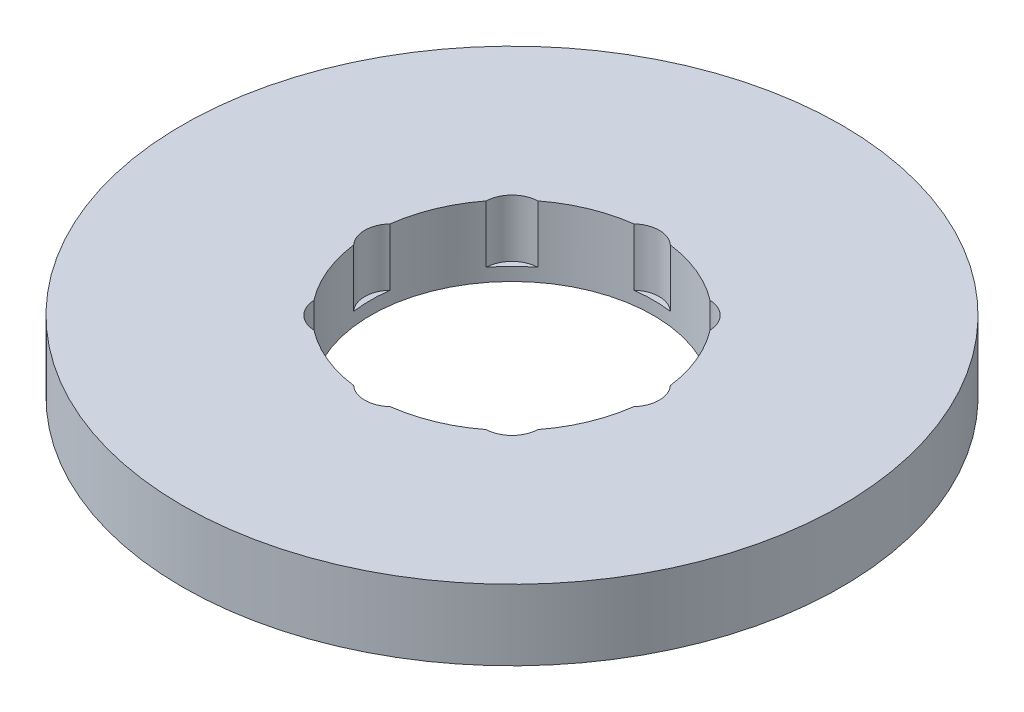
ISO-10303-21;
HEADER;
FILE_DESCRIPTION(('STEP AP214'),'2;1');
FILE_NAME('part.step','',(''),(''),'','','');
FILE_SCHEMA(('AUTOMOTIVE_DESIGN { 1 0 10303 214 1 1 1 1 }'));
ENDSEC;
DATA;
#1=APPLICATION_CONTEXT('core data for automotive mechanical design processes');
#2=APPLICATION_PROTOCOL_DEFINITION('international standard','automotive_design',2000,#1);
#3=PRODUCT_CONTEXT('',#1,'mechanical');
#4=PRODUCT('Part','Part','',(#3));
#5=PRODUCT_RELATED_PRODUCT_CATEGORY('part','',(#4));
#6=PRODUCT_DEFINITION_FORMATION('','',#4);
#7=PRODUCT_DEFINITION_CONTEXT('part definition',#1,'design');
#8=PRODUCT_DEFINITION('design','',#6,#7);
#9=PRODUCT_DEFINITION_SHAPE('','',#8);
#10=(LENGTH_UNIT() NAMED_UNIT(*) SI_UNIT(.MILLI.,.METRE.));
#11=(NAMED_UNIT(*) PLANE_ANGLE_UNIT() SI_UNIT($,.RADIAN.));
#12=(NAMED_UNIT(*) SI_UNIT($,.STERADIAN.) SOLID_ANGLE_UNIT());
#13=UNCERTAINTY_MEASURE_WITH_UNIT(LENGTH_MEASURE(1.E-05),#10,'distance_accuracy_value','');
#14=(GEOMETRIC_REPRESENTATION_CONTEXT(3) GLOBAL_UNCERTAINTY_ASSIGNED_CONTEXT((#13)) GLOBAL_UNIT_ASSIGNED_CONTEXT((#10,
#11,#12)) REPRESENTATION_CONTEXT('',''));
#15=CARTESIAN_POINT('',(0.,0.,0.));
#16=DIRECTION('',(0.,0.,1.));
#17=DIRECTION('',(1.,0.,0.));
#18=AXIS2_PLACEMENT_3D('',#15,#16,#17);
#19=CARTESIAN_POINT('',(0.,15.,0.));
#20=DIRECTION('',(0.,-1.,0.));
#21=DIRECTION('',(0.,0.,-1.));
#22=AXIS2_PLACEMENT_3D('',#19,#20,#21);
#23=CYLINDRICAL_SURFACE('',#22,70.);
#24=CARTESIAN_POINT('',(0.,15.,0.));
#25=DIRECTION('',(0.,1.,0.));
#26=DIRECTION('',(0.,0.,1.));
#27=AXIS2_PLACEMENT_3D('',#24,#25,#26);
#28=CIRCLE('',#27,70.);
#29=CARTESIAN_POINT('',(0.,15.,70.));
#30=VERTEX_POINT('',#29);
#31=EDGE_CURVE('E183',#30,#30,#28,.T.);
#32=ORIENTED_EDGE('',*,*,#31,.F.);
#33=EDGE_LOOP('',(#32));
#34=FACE_BOUND('',#33,.T.);
#35=CARTESIAN_POINT('',(0.,0.,0.));
#36=DIRECTION('',(0.,1.,0.));
#37=DIRECTION('',(0.,0.,1.));
#38=AXIS2_PLACEMENT_3D('',#35,#36,#37);
#39=CIRCLE('',#38,70.);
#40=CARTESIAN_POINT('',(0.,0.,70.));
#41=VERTEX_POINT('',#40);
#42=EDGE_CURVE('E182',#41,#41,#39,.T.);
#43=ORIENTED_EDGE('',*,*,#42,.T.);
#44=EDGE_LOOP('',(#43));
#45=FACE_BOUND('',#44,.T.);
#46=ADVANCED_FACE('F39',(#34,#45),#23,.T.);
#47=CARTESIAN_POINT('',(0.,15.,0.));
#48=DIRECTION('',(0.,1.,0.));
#49=DIRECTION('',(0.,0.,1.));
#50=AXIS2_PLACEMENT_3D('',#47,#48,#49);
#51=PLANE('',#50);
#52=CARTESIAN_POINT('',(0.,15.,25.5649603213193));
#53=DIRECTION('',(0.,1.,0.));
#54=DIRECTION('',(1.,0.,0.));
#55=AXIS2_PLACEMENT_3D('',#52,#53,#54);
#56=CIRCLE('',#55,5.70528538630194);
#57=CARTESIAN_POINT('',(-3.87966494125116,15.,29.7480789286237));
#58=VERTEX_POINT('',#57);
#59=CARTESIAN_POINT('',(3.87966494125137,15.,29.7480789286237));
#60=VERTEX_POINT('',#59);
#61=EDGE_CURVE('E256',#58,#60,#56,.T.);
#62=ORIENTED_EDGE('',*,*,#61,.F.);
#63=CARTESIAN_POINT('',(0.,15.,0.));
#64=DIRECTION('',(0.,1.,0.));
#65=DIRECTION('',(0.,0.,1.));
#66=AXIS2_PLACEMENT_3D('',#63,#64,#65);
#67=CIRCLE('',#66,30.);
#68=CARTESIAN_POINT('',(-18.291730949012,15.,23.778405726393));
#69=VERTEX_POINT('',#68);
#70=EDGE_CURVE('E175',#69,#58,#67,.T.);
#71=ORIENTED_EDGE('',*,*,#70,.F.);
#72=CARTESIAN_POINT('',(-18.0771568039699,15.,18.0771568039699));
#73=DIRECTION('',(0.,1.,0.));
#74=DIRECTION('',(0.707106781186549,0.,0.707106781186546));
#75=AXIS2_PLACEMENT_3D('',#72,#73,#74);
#76=CIRCLE('',#75,5.70528538630194);
#77=CARTESIAN_POINT('',(-23.7784057263929,15.,18.291730949012));
#78=VERTEX_POINT('',#77);
#79=EDGE_CURVE('E152',#78,#69,#76,.T.);
#80=ORIENTED_EDGE('',*,*,#79,.F.);
#81=CARTESIAN_POINT('',(-29.7480789286237,15.,3.87966494125126));
#82=VERTEX_POINT('',#81);
#83=EDGE_CURVE('E168',#82,#78,#67,.T.);
#84=ORIENTED_EDGE('',*,*,#83,.F.);
#85=CARTESIAN_POINT('',(-25.5649603213193,15.,0.));
#86=DIRECTION('',(0.,1.,0.));
#87=DIRECTION('',(0.,0.,1.));
#88=AXIS2_PLACEMENT_3D('',#85,#86,#87);
#89=CIRCLE('',#88,5.70528538630194);
#90=CARTESIAN_POINT('',(-29.7480789286237,15.,-3.87966494125126));
#91=VERTEX_POINT('',#90);
#92=EDGE_CURVE('E205',#91,#82,#89,.T.);
#93=ORIENTED_EDGE('',*,*,#92,.F.);
#94=CARTESIAN_POINT('',(-23.7784057263932,15.,-18.2917309490117));
#95=VERTEX_POINT('',#94);
#96=EDGE_CURVE('E181',#95,#91,#67,.T.);
#97=ORIENTED_EDGE('',*,*,#96,.F.);
#98=CARTESIAN_POINT('',(-18.0771568039701,15.,-18.0771568039697));
#99=DIRECTION('',(0.,1.,0.));
#100=DIRECTION('',(-0.707106781186539,0.,0.707106781186556));
#101=AXIS2_PLACEMENT_3D('',#98,#99,#100);
#102=CIRCLE('',#101,5.70528538630194);
#103=CARTESIAN_POINT('',(-18.2917309490123,15.,-23.7784057263927));
#104=VERTEX_POINT('',#103);
#105=EDGE_CURVE('E453',#104,#95,#102,.T.);
#106=ORIENTED_EDGE('',*,*,#105,.F.);
#107=CARTESIAN_POINT('',(-3.87966494125158,15.,-29.7480789286237));
#108=VERTEX_POINT('',#107);
#109=EDGE_CURVE('E189',#108,#104,#67,.T.);
#110=ORIENTED_EDGE('',*,*,#109,.F.);
#111=CARTESIAN_POINT('',(-2.67778745670455E-13,15.,-25.5649603213193));
#112=DIRECTION('',(0.,1.,0.));
#113=DIRECTION('',(-1.,0.,0.));
#114=AXIS2_PLACEMENT_3D('',#111,#112,#113);
#115=CIRCLE('',#114,5.70528538630194);
#116=CARTESIAN_POINT('',(3.87966494125095,15.,-29.7480789286237));
#117=VERTEX_POINT('',#116);
#118=EDGE_CURVE('E462',#117,#108,#115,.T.);
#119=ORIENTED_EDGE('',*,*,#118,.F.);
#120=CARTESIAN_POINT('',(18.2917309490118,15.,-23.7784057263931));
#121=VERTEX_POINT('',#120);
#122=EDGE_CURVE('E197',#121,#117,#67,.T.);
#123=ORIENTED_EDGE('',*,*,#122,.F.);
#124=CARTESIAN_POINT('',(18.0771568039697,15.,-18.0771568039701));
#125=DIRECTION('',(0.,1.,0.));
#126=DIRECTION('',(-0.707106781186554,0.,-0.707106781186541));
#127=AXIS2_PLACEMENT_3D('',#124,#125,#126);
#128=CIRCLE('',#127,5.70528538630194);
#129=CARTESIAN_POINT('',(23.7784057263928,15.,-18.2917309490122));
#130=VERTEX_POINT('',#129);
#131=EDGE_CURVE('E470',#130,#121,#128,.T.);
#132=ORIENTED_EDGE('',*,*,#131,.F.);
#133=CARTESIAN_POINT('',(29.7480789286237,15.,-3.87966494125126));
#134=VERTEX_POINT('',#133);
#135=EDGE_CURVE('E489',#134,#130,#67,.T.);
#136=ORIENTED_EDGE('',*,*,#135,.F.);
#137=CARTESIAN_POINT('',(25.5649603213193,15.,0.));
#138=DIRECTION('',(0.,1.,0.));
#139=DIRECTION('',(0.,0.,-1.));
#140=AXIS2_PLACEMENT_3D('',#137,#138,#139);
#141=CIRCLE('',#140,5.70528538630194);
#142=CARTESIAN_POINT('',(29.7480789286237,15.,3.87966494125126));
#143=VERTEX_POINT('',#142);
#144=EDGE_CURVE('E476',#143,#134,#141,.T.);
#145=ORIENTED_EDGE('',*,*,#144,.F.);
#146=CARTESIAN_POINT('',(23.778405726393,15.,18.2917309490119));
#147=VERTEX_POINT('',#146);
#148=EDGE_CURVE('E491',#147,#143,#67,.T.);
#149=ORIENTED_EDGE('',*,*,#148,.F.);
#150=CARTESIAN_POINT('',(18.07715680397,15.,18.0771568039698));
#151=DIRECTION('',(0.,1.,0.));
#152=DIRECTION('',(0.707106781186544,0.,-0.707106781186551));
#153=AXIS2_PLACEMENT_3D('',#150,#151,#152);
#154=CIRCLE('',#153,5.70528538630194);
#155=CARTESIAN_POINT('',(18.2917309490121,15.,23.7784057263928));
#156=VERTEX_POINT('',#155);
#157=EDGE_CURVE('E475',#156,#147,#154,.T.);
#158=ORIENTED_EDGE('',*,*,#157,.F.);
#159=EDGE_CURVE('E190',#60,#156,#67,.T.);
#160=ORIENTED_EDGE('',*,*,#159,.F.);
#161=EDGE_LOOP('',(#62,#71,#80,#84,#93,#97,#106,#110,#119,#123,#132,#136,#145,#149,#158,#160));
#162=FACE_BOUND('',#161,.T.);
#163=ORIENTED_EDGE('',*,*,#31,.T.);
#164=EDGE_LOOP('',(#163));
#165=FACE_BOUND('',#164,.T.);
#166=ADVANCED_FACE('F170',(#162,#165),#51,.T.);
#167=CARTESIAN_POINT('',(0.,0.,0.));
#168=DIRECTION('',(0.,1.,0.));
#169=DIRECTION('',(0.,0.,1.));
#170=AXIS2_PLACEMENT_3D('',#167,#168,#169);
#171=PLANE('',#170);
#172=CARTESIAN_POINT('',(0.,0.,0.));
#173=DIRECTION('',(0.,1.,0.));
#174=DIRECTION('',(0.,0.,1.));
#175=AXIS2_PLACEMENT_3D('',#172,#173,#174);
#176=CIRCLE('',#175,30.);
#177=CARTESIAN_POINT('',(0.,0.,30.));
#178=VERTEX_POINT('',#177);
#179=EDGE_CURVE('E191',#178,#178,#176,.T.);
#180=ORIENTED_EDGE('',*,*,#179,.T.);
#181=EDGE_LOOP('',(#180));
#182=FACE_BOUND('',#181,.T.);
#183=ORIENTED_EDGE('',*,*,#42,.F.);
#184=EDGE_LOOP('',(#183));
#185=FACE_BOUND('',#184,.T.);
#186=ADVANCED_FACE('F277',(#182,#185),#171,.F.);
#187=CARTESIAN_POINT('',(0.,15.,0.));
#188=DIRECTION('',(0.,-1.,0.));
#189=DIRECTION('',(0.,0.,-1.));
#190=AXIS2_PLACEMENT_3D('',#187,#188,#189);
#191=CYLINDRICAL_SURFACE('',#190,30.);
#192=DIRECTION('',(0.,1.,0.));
#193=VECTOR('',#192,1.);
#194=CARTESIAN_POINT('',(-3.87966494125118,8.89638853081518,29.7480789286237));
#195=LINE('',#194,#193);
#196=CARTESIAN_POINT('',(-3.87966494125116,2.79277706163036,29.7480789286237));
#197=VERTEX_POINT('',#196);
#198=EDGE_CURVE('E11',#197,#58,#195,.T.);
#199=ORIENTED_EDGE('',*,*,#198,.F.);
#200=CARTESIAN_POINT('',(0.,2.79277706163036,0.));
#201=DIRECTION('',(0.,1.,0.));
#202=DIRECTION('',(0.,0.,1.));
#203=AXIS2_PLACEMENT_3D('',#200,#201,#202);
#204=CIRCLE('',#203,30.);
#205=CARTESIAN_POINT('',(3.87966494125137,2.79277706163036,29.7480789286237));
#206=VERTEX_POINT('',#205);
#207=EDGE_CURVE('E251',#197,#206,#204,.T.);
#208=ORIENTED_EDGE('',*,*,#207,.T.);
#209=DIRECTION('',(0.,1.,0.));
#210=VECTOR('',#209,1.);
#211=CARTESIAN_POINT('',(3.87966494125139,8.89638853081518,29.7480789286237));
#212=LINE('',#211,#210);
#213=EDGE_CURVE('E46',#60,#206,#212,.F.);
#214=ORIENTED_EDGE('',*,*,#213,.F.);
#215=ORIENTED_EDGE('',*,*,#159,.T.);
#216=DIRECTION('',(0.,1.,0.));
#217=VECTOR('',#216,1.);
#218=CARTESIAN_POINT('',(18.2917309490121,8.89638853081518,23.7784057263928));
#219=LINE('',#218,#217);
#220=CARTESIAN_POINT('',(18.2917309490121,2.79277706163036,23.7784057263928));
#221=VERTEX_POINT('',#220);
#222=EDGE_CURVE('E253',#221,#156,#219,.T.);
#223=ORIENTED_EDGE('',*,*,#222,.F.);
#224=CARTESIAN_POINT('',(0.,2.79277706163036,0.));
#225=DIRECTION('',(0.,1.,0.));
#226=DIRECTION('',(0.,0.,1.));
#227=AXIS2_PLACEMENT_3D('',#224,#225,#226);
#228=CIRCLE('',#227,30.);
#229=CARTESIAN_POINT('',(23.778405726393,2.79277706163036,18.2917309490119));
#230=VERTEX_POINT('',#229);
#231=EDGE_CURVE('E246',#221,#230,#228,.T.);
#232=ORIENTED_EDGE('',*,*,#231,.T.);
#233=DIRECTION('',(0.,1.,0.));
#234=VECTOR('',#233,1.);
#235=CARTESIAN_POINT('',(23.778405726393,8.89638853081518,18.2917309490118));
#236=LINE('',#235,#234);
#237=EDGE_CURVE('E248',#147,#230,#236,.F.);
#238=ORIENTED_EDGE('',*,*,#237,.F.);
#239=ORIENTED_EDGE('',*,*,#148,.T.);
#240=DIRECTION('',(0.,1.,0.));
#241=VECTOR('',#240,1.);
#242=CARTESIAN_POINT('',(29.7480789286237,8.89638853081518,3.87966494125128));
#243=LINE('',#242,#241);
#244=CARTESIAN_POINT('',(29.7480789286237,2.79277706163036,3.87966494125126));
#245=VERTEX_POINT('',#244);
#246=EDGE_CURVE('E243',#245,#143,#243,.T.);
#247=ORIENTED_EDGE('',*,*,#246,.F.);
#248=CARTESIAN_POINT('',(0.,2.79277706163036,0.));
#249=DIRECTION('',(0.,1.,0.));
#250=DIRECTION('',(0.,0.,1.));
#251=AXIS2_PLACEMENT_3D('',#248,#249,#250);
#252=CIRCLE('',#251,30.);
#253=CARTESIAN_POINT('',(29.7480789286237,2.79277706163036,-3.87966494125126));
#254=VERTEX_POINT('',#253);
#255=EDGE_CURVE('E236',#245,#254,#252,.T.);
#256=ORIENTED_EDGE('',*,*,#255,.T.);
#257=DIRECTION('',(0.,1.,0.));
#258=VECTOR('',#257,1.);
#259=CARTESIAN_POINT('',(29.7480789286237,8.89638853081518,-3.87966494125128));
#260=LINE('',#259,#258);
#261=EDGE_CURVE('E241',#134,#254,#260,.F.);
#262=ORIENTED_EDGE('',*,*,#261,.F.);
#263=ORIENTED_EDGE('',*,*,#135,.T.);
#264=DIRECTION('',(0.,1.,0.));
#265=VECTOR('',#264,1.);
#266=CARTESIAN_POINT('',(23.7784057263928,8.89638853081518,-18.2917309490122));
#267=LINE('',#266,#265);
#268=CARTESIAN_POINT('',(23.7784057263928,2.79277706163036,-18.2917309490122));
#269=VERTEX_POINT('',#268);
#270=EDGE_CURVE('E237',#269,#130,#267,.T.);
#271=ORIENTED_EDGE('',*,*,#270,.F.);
#272=CARTESIAN_POINT('',(0.,2.79277706163036,0.));
#273=DIRECTION('',(0.,1.,0.));
#274=DIRECTION('',(0.,0.,1.));
#275=AXIS2_PLACEMENT_3D('',#272,#273,#274);
#276=CIRCLE('',#275,30.);
#277=CARTESIAN_POINT('',(18.2917309490118,2.79277706163036,-23.7784057263931));
#278=VERTEX_POINT('',#277);
#279=EDGE_CURVE('E229',#269,#278,#276,.T.);
#280=ORIENTED_EDGE('',*,*,#279,.T.);
#281=DIRECTION('',(0.,1.,0.));
#282=VECTOR('',#281,1.);
#283=CARTESIAN_POINT('',(18.2917309490118,8.89638853081518,-23.7784057263931));
#284=LINE('',#283,#282);
#285=EDGE_CURVE('E232',#121,#278,#284,.F.);
#286=ORIENTED_EDGE('',*,*,#285,.F.);
#287=ORIENTED_EDGE('',*,*,#122,.T.);
#288=DIRECTION('',(0.,1.,0.));
#289=VECTOR('',#288,1.);
#290=CARTESIAN_POINT('',(3.87966494125097,8.89638853081518,-29.7480789286237));
#291=LINE('',#290,#289);
#292=CARTESIAN_POINT('',(3.87966494125095,2.79277706163036,-29.7480789286237));
#293=VERTEX_POINT('',#292);
#294=EDGE_CURVE('E227',#293,#117,#291,.T.);
#295=ORIENTED_EDGE('',*,*,#294,.F.);
#296=CARTESIAN_POINT('',(0.,2.79277706163036,0.));
#297=DIRECTION('',(0.,1.,0.));
#298=DIRECTION('',(0.,0.,1.));
#299=AXIS2_PLACEMENT_3D('',#296,#297,#298);
#300=CIRCLE('',#299,30.);
#301=CARTESIAN_POINT('',(-3.87966494125158,2.79277706163036,-29.7480789286237));
#302=VERTEX_POINT('',#301);
#303=EDGE_CURVE('E225',#293,#302,#300,.T.);
#304=ORIENTED_EDGE('',*,*,#303,.T.);
#305=DIRECTION('',(0.,1.,0.));
#306=VECTOR('',#305,1.);
#307=CARTESIAN_POINT('',(-3.87966494125159,8.89638853081518,-29.7480789286236));
#308=LINE('',#307,#306);
#309=EDGE_CURVE('E223',#108,#302,#308,.F.);
#310=ORIENTED_EDGE('',*,*,#309,.F.);
#311=ORIENTED_EDGE('',*,*,#109,.T.);
#312=DIRECTION('',(0.,1.,0.));
#313=VECTOR('',#312,1.);
#314=CARTESIAN_POINT('',(-18.2917309490123,8.89638853081518,-23.7784057263927));
#315=LINE('',#314,#313);
#316=CARTESIAN_POINT('',(-18.2917309490123,2.79277706163036,-23.7784057263927));
#317=VERTEX_POINT('',#316);
#318=EDGE_CURVE('E219',#317,#104,#315,.T.);
#319=ORIENTED_EDGE('',*,*,#318,.F.);
#320=CARTESIAN_POINT('',(0.,2.79277706163036,0.));
#321=DIRECTION('',(0.,1.,0.));
#322=DIRECTION('',(0.,0.,1.));
#323=AXIS2_PLACEMENT_3D('',#320,#321,#322);
#324=CIRCLE('',#323,30.);
#325=CARTESIAN_POINT('',(-23.7784057263932,2.79277706163036,-18.2917309490117));
#326=VERTEX_POINT('',#325);
#327=EDGE_CURVE('E159',#317,#326,#324,.T.);
#328=ORIENTED_EDGE('',*,*,#327,.T.);
#329=DIRECTION('',(0.,1.,0.));
#330=VECTOR('',#329,1.);
#331=CARTESIAN_POINT('',(-23.7784057263932,8.89638853081518,-18.2917309490117));
#332=LINE('',#331,#330);
#333=EDGE_CURVE('E220',#95,#326,#332,.F.);
#334=ORIENTED_EDGE('',*,*,#333,.F.);
#335=ORIENTED_EDGE('',*,*,#96,.T.);
#336=DIRECTION('',(0.,1.,0.));
#337=VECTOR('',#336,1.);
#338=CARTESIAN_POINT('',(-29.7480789286237,8.89638853081518,-3.87966494125128));
#339=LINE('',#338,#337);
#340=CARTESIAN_POINT('',(-29.7480789286237,2.79277706163036,-3.87966494125126));
#341=VERTEX_POINT('',#340);
#342=EDGE_CURVE('E209',#341,#91,#339,.T.);
#343=ORIENTED_EDGE('',*,*,#342,.F.);
#344=CARTESIAN_POINT('',(0.,2.79277706163036,0.));
#345=DIRECTION('',(0.,1.,0.));
#346=DIRECTION('',(0.,0.,1.));
#347=AXIS2_PLACEMENT_3D('',#344,#345,#346);
#348=CIRCLE('',#347,30.);
#349=CARTESIAN_POINT('',(-29.7480789286237,2.79277706163036,3.87966494125126));
#350=VERTEX_POINT('',#349);
#351=EDGE_CURVE('E206',#341,#350,#348,.T.);
#352=ORIENTED_EDGE('',*,*,#351,.T.);
#353=DIRECTION('',(0.,1.,0.));
#354=VECTOR('',#353,1.);
#355=CARTESIAN_POINT('',(-29.7480789286237,8.89638853081518,3.87966494125128));
#356=LINE('',#355,#354);
#357=EDGE_CURVE('E179',#82,#350,#356,.F.);
#358=ORIENTED_EDGE('',*,*,#357,.F.);
#359=ORIENTED_EDGE('',*,*,#83,.T.);
#360=DIRECTION('',(0.,1.,0.));
#361=VECTOR('',#360,1.);
#362=CARTESIAN_POINT('',(-23.7784057263929,8.89638853081518,18.291730949012));
#363=LINE('',#362,#361);
#364=CARTESIAN_POINT('',(-23.7784057263929,2.79277706163036,18.291730949012));
#365=VERTEX_POINT('',#364);
#366=EDGE_CURVE('E147',#365,#78,#363,.T.);
#367=ORIENTED_EDGE('',*,*,#366,.F.);
#368=CARTESIAN_POINT('',(0.,2.79277706163036,0.));
#369=DIRECTION('',(0.,1.,0.));
#370=DIRECTION('',(0.,0.,1.));
#371=AXIS2_PLACEMENT_3D('',#368,#369,#370);
#372=CIRCLE('',#371,30.);
#373=CARTESIAN_POINT('',(-18.291730949012,2.79277706163036,23.778405726393));
#374=VERTEX_POINT('',#373);
#375=EDGE_CURVE('E215',#365,#374,#372,.T.);
#376=ORIENTED_EDGE('',*,*,#375,.T.);
#377=DIRECTION('',(0.,1.,0.));
#378=VECTOR('',#377,1.);
#379=CARTESIAN_POINT('',(-18.2917309490119,8.89638853081518,23.778405726393));
#380=LINE('',#379,#378);
#381=EDGE_CURVE('E161',#69,#374,#380,.F.);
#382=ORIENTED_EDGE('',*,*,#381,.F.);
#383=ORIENTED_EDGE('',*,*,#70,.T.);
#384=EDGE_LOOP('',(#199,#208,#214,#215,#223,#232,#238,#239,#247,#256,#262,#263,#271,#280,#286,
#287,#295,#304,#310,#311,#319,#328,#334,#335,#343,#352,#358,#359,#367,#376,#382,#383));
#385=FACE_BOUND('',#384,.T.);
#386=ORIENTED_EDGE('',*,*,#179,.F.);
#387=EDGE_LOOP('',(#386));
#388=FACE_BOUND('',#387,.T.);
#389=ADVANCED_FACE('F176',(#385,#388),#191,.F.);
#390=CARTESIAN_POINT('',(-25.5649603213193,2.79277706163036,0.));
#391=DIRECTION('',(0.,1.,0.));
#392=DIRECTION('',(0.,0.,1.));
#393=AXIS2_PLACEMENT_3D('',#390,#391,#392);
#394=CYLINDRICAL_SURFACE('',#393,5.70528538630194);
#395=ORIENTED_EDGE('',*,*,#342,.T.);
#396=ORIENTED_EDGE('',*,*,#92,.T.);
#397=ORIENTED_EDGE('',*,*,#357,.T.);
#398=CARTESIAN_POINT('',(-25.5649603213193,2.79277706163036,0.));
#399=DIRECTION('',(0.,1.,0.));
#400=DIRECTION('',(0.,0.,1.));
#401=AXIS2_PLACEMENT_3D('',#398,#399,#400);
#402=CIRCLE('',#401,5.70528538630194);
#403=EDGE_CURVE('E200',#341,#350,#402,.T.);
#404=ORIENTED_EDGE('',*,*,#403,.F.);
#405=EDGE_LOOP('',(#395,#396,#397,#404));
#406=FACE_BOUND('',#405,.T.);
#407=ADVANCED_FACE('F286',(#406),#394,.F.);
#408=CARTESIAN_POINT('',(-25.5649603213193,2.79277706163036,0.));
#409=DIRECTION('',(0.,1.,0.));
#410=DIRECTION('',(0.,0.,1.));
#411=AXIS2_PLACEMENT_3D('',#408,#409,#410);
#412=PLANE('',#411);
#413=ORIENTED_EDGE('',*,*,#403,.T.);
#414=ORIENTED_EDGE('',*,*,#351,.F.);
#415=EDGE_LOOP('',(#413,#414));
#416=FACE_BOUND('',#415,.T.);
#417=ADVANCED_FACE('F289',(#416),#412,.T.);
#418=CARTESIAN_POINT('',(-18.0771568039699,2.79277706163036,18.0771568039699));
#419=DIRECTION('',(0.,1.,0.));
#420=DIRECTION('',(0.,0.,1.));
#421=AXIS2_PLACEMENT_3D('',#418,#419,#420);
#422=CYLINDRICAL_SURFACE('',#421,5.70528538630194);
#423=ORIENTED_EDGE('',*,*,#366,.T.);
#424=ORIENTED_EDGE('',*,*,#79,.T.);
#425=ORIENTED_EDGE('',*,*,#381,.T.);
#426=CARTESIAN_POINT('',(-18.0771568039699,2.79277706163036,18.0771568039699));
#427=DIRECTION('',(0.,1.,0.));
#428=DIRECTION('',(0.707106781186549,0.,0.707106781186546));
#429=AXIS2_PLACEMENT_3D('',#426,#427,#428);
#430=CIRCLE('',#429,5.70528538630194);
#431=EDGE_CURVE('E156',#365,#374,#430,.T.);
#432=ORIENTED_EDGE('',*,*,#431,.F.);
#433=EDGE_LOOP('',(#423,#424,#425,#432));
#434=FACE_BOUND('',#433,.T.);
#435=ADVANCED_FACE('F155',(#434),#422,.F.);
#436=CARTESIAN_POINT('',(-18.0771568039699,2.79277706163036,18.0771568039699));
#437=DIRECTION('',(0.,1.,0.));
#438=DIRECTION('',(0.707106781186549,0.,0.707106781186546));
#439=AXIS2_PLACEMENT_3D('',#436,#437,#438);
#440=PLANE('',#439);
#441=ORIENTED_EDGE('',*,*,#431,.T.);
#442=ORIENTED_EDGE('',*,*,#375,.F.);
#443=EDGE_LOOP('',(#441,#442));
#444=FACE_BOUND('',#443,.T.);
#445=ADVANCED_FACE('F300',(#444),#440,.T.);
#446=CARTESIAN_POINT('',(-18.0771568039701,2.79277706163036,-18.0771568039697));
#447=DIRECTION('',(0.,1.,0.));
#448=DIRECTION('',(0.,0.,1.));
#449=AXIS2_PLACEMENT_3D('',#446,#447,#448);
#450=CYLINDRICAL_SURFACE('',#449,5.70528538630194);
#451=ORIENTED_EDGE('',*,*,#318,.T.);
#452=ORIENTED_EDGE('',*,*,#105,.T.);
#453=ORIENTED_EDGE('',*,*,#333,.T.);
#454=CARTESIAN_POINT('',(-18.0771568039701,2.79277706163036,-18.0771568039697));
#455=DIRECTION('',(0.,1.,0.));
#456=DIRECTION('',(-0.707106781186539,0.,0.707106781186556));
#457=AXIS2_PLACEMENT_3D('',#454,#455,#456);
#458=CIRCLE('',#457,5.70528538630194);
#459=EDGE_CURVE('E454',#317,#326,#458,.T.);
#460=ORIENTED_EDGE('',*,*,#459,.F.);
#461=EDGE_LOOP('',(#451,#452,#453,#460));
#462=FACE_BOUND('',#461,.T.);
#463=ADVANCED_FACE('F299',(#462),#450,.F.);
#464=CARTESIAN_POINT('',(-18.0771568039701,2.79277706163036,-18.0771568039697));
#465=DIRECTION('',(0.,1.,0.));
#466=DIRECTION('',(-0.707106781186539,0.,0.707106781186556));
#467=AXIS2_PLACEMENT_3D('',#464,#465,#466);
#468=PLANE('',#467);
#469=ORIENTED_EDGE('',*,*,#459,.T.);
#470=ORIENTED_EDGE('',*,*,#327,.F.);
#471=EDGE_LOOP('',(#469,#470));
#472=FACE_BOUND('',#471,.T.);
#473=ADVANCED_FACE('F379',(#472),#468,.T.);
#474=CARTESIAN_POINT('',(-2.67778745670455E-13,2.79277706163036,-25.5649603213193));
#475=DIRECTION('',(0.,1.,0.));
#476=DIRECTION('',(0.,0.,1.));
#477=AXIS2_PLACEMENT_3D('',#474,#475,#476);
#478=CYLINDRICAL_SURFACE('',#477,5.70528538630194);
#479=ORIENTED_EDGE('',*,*,#294,.T.);
#480=ORIENTED_EDGE('',*,*,#118,.T.);
#481=ORIENTED_EDGE('',*,*,#309,.T.);
#482=CARTESIAN_POINT('',(-2.67778745670455E-13,2.79277706163036,-25.5649603213193));
#483=DIRECTION('',(0.,1.,0.));
#484=DIRECTION('',(-1.,0.,0.));
#485=AXIS2_PLACEMENT_3D('',#482,#483,#484);
#486=CIRCLE('',#485,5.70528538630194);
#487=EDGE_CURVE('E465',#293,#302,#486,.T.);
#488=ORIENTED_EDGE('',*,*,#487,.F.);
#489=EDGE_LOOP('',(#479,#480,#481,#488));
#490=FACE_BOUND('',#489,.T.);
#491=ADVANCED_FACE('F371',(#490),#478,.F.);
#492=CARTESIAN_POINT('',(-2.67778745670455E-13,2.79277706163036,-25.5649603213193));
#493=DIRECTION('',(0.,1.,0.));
#494=DIRECTION('',(-1.,0.,0.));
#495=AXIS2_PLACEMENT_3D('',#492,#493,#494);
#496=PLANE('',#495);
#497=ORIENTED_EDGE('',*,*,#487,.T.);
#498=ORIENTED_EDGE('',*,*,#303,.F.);
#499=EDGE_LOOP('',(#497,#498));
#500=FACE_BOUND('',#499,.T.);
#501=ADVANCED_FACE('F308',(#500),#496,.T.);
#502=CARTESIAN_POINT('',(18.0771568039697,2.79277706163036,-18.0771568039701));
#503=DIRECTION('',(0.,1.,0.));
#504=DIRECTION('',(0.,0.,1.));
#505=AXIS2_PLACEMENT_3D('',#502,#503,#504);
#506=CYLINDRICAL_SURFACE('',#505,5.70528538630194);
#507=ORIENTED_EDGE('',*,*,#270,.T.);
#508=ORIENTED_EDGE('',*,*,#131,.T.);
#509=ORIENTED_EDGE('',*,*,#285,.T.);
#510=CARTESIAN_POINT('',(18.0771568039697,2.79277706163036,-18.0771568039701));
#511=DIRECTION('',(0.,1.,0.));
#512=DIRECTION('',(-0.707106781186554,0.,-0.707106781186541));
#513=AXIS2_PLACEMENT_3D('',#510,#511,#512);
#514=CIRCLE('',#513,5.70528538630194);
#515=EDGE_CURVE('E477',#269,#278,#514,.T.);
#516=ORIENTED_EDGE('',*,*,#515,.F.);
#517=EDGE_LOOP('',(#507,#508,#509,#516));
#518=FACE_BOUND('',#517,.T.);
#519=ADVANCED_FACE('F305',(#518),#506,.F.);
#520=CARTESIAN_POINT('',(18.0771568039697,2.79277706163036,-18.0771568039701));
#521=DIRECTION('',(0.,1.,0.));
#522=DIRECTION('',(-0.707106781186554,0.,-0.707106781186541));
#523=AXIS2_PLACEMENT_3D('',#520,#521,#522);
#524=PLANE('',#523);
#525=ORIENTED_EDGE('',*,*,#515,.T.);
#526=ORIENTED_EDGE('',*,*,#279,.F.);
#527=EDGE_LOOP('',(#525,#526));
#528=FACE_BOUND('',#527,.T.);
#529=ADVANCED_FACE('F304',(#528),#524,.T.);
#530=CARTESIAN_POINT('',(25.5649603213193,2.79277706163036,0.));
#531=DIRECTION('',(0.,1.,0.));
#532=DIRECTION('',(0.,0.,1.));
#533=AXIS2_PLACEMENT_3D('',#530,#531,#532);
#534=CYLINDRICAL_SURFACE('',#533,5.70528538630194);
#535=ORIENTED_EDGE('',*,*,#246,.T.);
#536=ORIENTED_EDGE('',*,*,#144,.T.);
#537=ORIENTED_EDGE('',*,*,#261,.T.);
#538=CARTESIAN_POINT('',(25.5649603213193,2.79277706163036,0.));
#539=DIRECTION('',(0.,1.,0.));
#540=DIRECTION('',(0.,0.,-1.));
#541=AXIS2_PLACEMENT_3D('',#538,#539,#540);
#542=CIRCLE('',#541,5.70528538630194);
#543=EDGE_CURVE('E478',#245,#254,#542,.T.);
#544=ORIENTED_EDGE('',*,*,#543,.F.);
#545=EDGE_LOOP('',(#535,#536,#537,#544));
#546=FACE_BOUND('',#545,.T.);
#547=ADVANCED_FACE('F309',(#546),#534,.F.);
#548=CARTESIAN_POINT('',(25.5649603213193,2.79277706163036,0.));
#549=DIRECTION('',(0.,1.,0.));
#550=DIRECTION('',(0.,0.,-1.));
#551=AXIS2_PLACEMENT_3D('',#548,#549,#550);
#552=PLANE('',#551);
#553=ORIENTED_EDGE('',*,*,#543,.T.);
#554=ORIENTED_EDGE('',*,*,#255,.F.);
#555=EDGE_LOOP('',(#553,#554));
#556=FACE_BOUND('',#555,.T.);
#557=ADVANCED_FACE('F314',(#556),#552,.T.);
#558=CARTESIAN_POINT('',(18.07715680397,2.79277706163036,18.0771568039698));
#559=DIRECTION('',(0.,1.,0.));
#560=DIRECTION('',(0.,0.,1.));
#561=AXIS2_PLACEMENT_3D('',#558,#559,#560);
#562=CYLINDRICAL_SURFACE('',#561,5.70528538630194);
#563=ORIENTED_EDGE('',*,*,#222,.T.);
#564=ORIENTED_EDGE('',*,*,#157,.T.);
#565=ORIENTED_EDGE('',*,*,#237,.T.);
#566=CARTESIAN_POINT('',(18.07715680397,2.79277706163036,18.0771568039698));
#567=DIRECTION('',(0.,1.,0.));
#568=DIRECTION('',(0.707106781186544,0.,-0.707106781186551));
#569=AXIS2_PLACEMENT_3D('',#566,#567,#568);
#570=CIRCLE('',#569,5.70528538630194);
#571=EDGE_CURVE('E56',#221,#230,#570,.T.);
#572=ORIENTED_EDGE('',*,*,#571,.F.);
#573=EDGE_LOOP('',(#563,#564,#565,#572));
#574=FACE_BOUND('',#573,.T.);
#575=ADVANCED_FACE('F318',(#574),#562,.F.);
#576=CARTESIAN_POINT('',(18.07715680397,2.79277706163036,18.0771568039698));
#577=DIRECTION('',(0.,1.,0.));
#578=DIRECTION('',(0.707106781186544,0.,-0.707106781186551));
#579=AXIS2_PLACEMENT_3D('',#576,#577,#578);
#580=PLANE('',#579);
#581=ORIENTED_EDGE('',*,*,#571,.T.);
#582=ORIENTED_EDGE('',*,*,#231,.F.);
#583=EDGE_LOOP('',(#581,#582));
#584=FACE_BOUND('',#583,.T.);
#585=ADVANCED_FACE('F270',(#584),#580,.T.);
#586=CARTESIAN_POINT('',(0.,2.79277706163036,25.5649603213193));
#587=DIRECTION('',(0.,1.,0.));
#588=DIRECTION('',(0.,0.,1.));
#589=AXIS2_PLACEMENT_3D('',#586,#587,#588);
#590=CYLINDRICAL_SURFACE('',#589,5.70528538630194);
#591=ORIENTED_EDGE('',*,*,#198,.T.);
#592=ORIENTED_EDGE('',*,*,#61,.T.);
#593=ORIENTED_EDGE('',*,*,#213,.T.);
#594=CARTESIAN_POINT('',(0.,2.79277706163036,25.5649603213193));
#595=DIRECTION('',(0.,1.,0.));
#596=DIRECTION('',(1.,0.,0.));
#597=AXIS2_PLACEMENT_3D('',#594,#595,#596);
#598=CIRCLE('',#597,5.70528538630194);
#599=EDGE_CURVE('E55',#197,#206,#598,.T.);
#600=ORIENTED_EDGE('',*,*,#599,.F.);
#601=EDGE_LOOP('',(#591,#592,#593,#600));
#602=FACE_BOUND('',#601,.T.);
#603=ADVANCED_FACE('F260',(#602),#590,.F.);
#604=CARTESIAN_POINT('',(0.,2.79277706163036,25.5649603213193));
#605=DIRECTION('',(0.,1.,0.));
#606=DIRECTION('',(1.,0.,0.));
#607=AXIS2_PLACEMENT_3D('',#604,#605,#606);
#608=PLANE('',#607);
#609=ORIENTED_EDGE('',*,*,#599,.T.);
#610=ORIENTED_EDGE('',*,*,#207,.F.);
#611=EDGE_LOOP('',(#609,#610));
#612=FACE_BOUND('',#611,.T.);
#613=ADVANCED_FACE('F261',(#612),#608,.T.);
#614=CLOSED_SHELL('',(#46,#166,#186,#389,#407,#417,#435,#445,#463,#473,#491,#501,#519,#529,#547,
#557,#575,#585,#603,#613));
#615=MANIFOLD_SOLID_BREP('B2',#614);
#616=ADVANCED_BREP_SHAPE_REPRESENTATION('',(#18,#615),#14);
#617=SHAPE_DEFINITION_REPRESENTATION(#9,#616);
ENDSEC;
END-ISO-10303-21;
